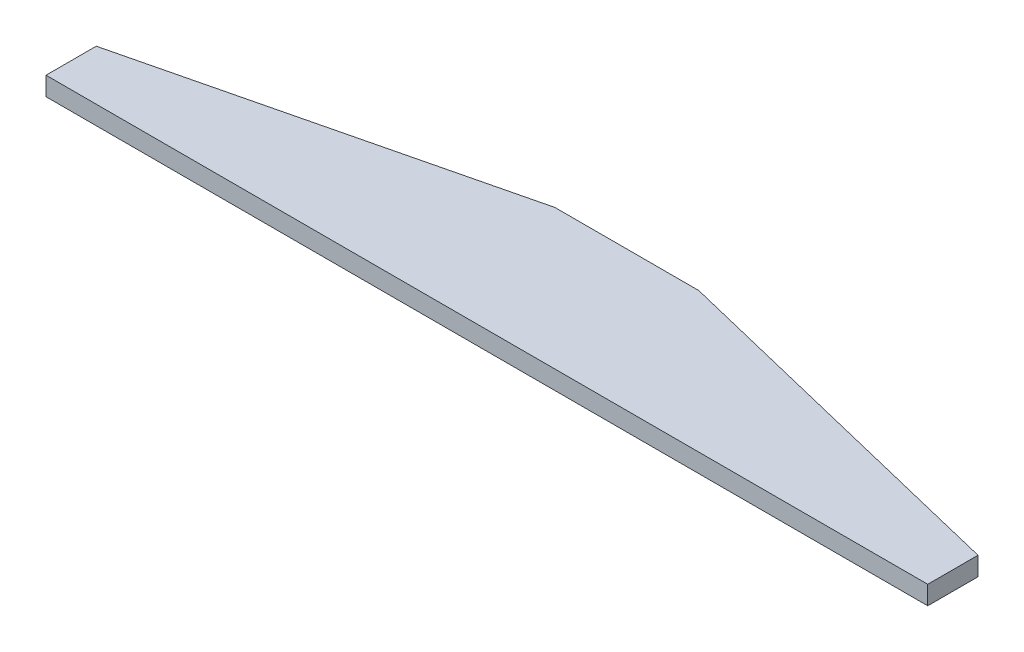
ISO-10303-21;
HEADER;
FILE_DESCRIPTION(('STEP AP214'),'2;1');
FILE_NAME('part.step','',(''),(''),'','','');
FILE_SCHEMA(('AUTOMOTIVE_DESIGN { 1 0 10303 214 1 1 1 1 }'));
ENDSEC;
DATA;
#1=APPLICATION_CONTEXT('core data for automotive mechanical design processes');
#2=APPLICATION_PROTOCOL_DEFINITION('international standard','automotive_design',2000,#1);
#3=PRODUCT_CONTEXT('',#1,'mechanical');
#4=PRODUCT('Part','Part','',(#3));
#5=PRODUCT_RELATED_PRODUCT_CATEGORY('part','',(#4));
#6=PRODUCT_DEFINITION_FORMATION('','',#4);
#7=PRODUCT_DEFINITION_CONTEXT('part definition',#1,'design');
#8=PRODUCT_DEFINITION('design','',#6,#7);
#9=PRODUCT_DEFINITION_SHAPE('','',#8);
#10=(LENGTH_UNIT() NAMED_UNIT(*) SI_UNIT(.MILLI.,.METRE.));
#11=(NAMED_UNIT(*) PLANE_ANGLE_UNIT() SI_UNIT($,.RADIAN.));
#12=(NAMED_UNIT(*) SI_UNIT($,.STERADIAN.) SOLID_ANGLE_UNIT());
#13=UNCERTAINTY_MEASURE_WITH_UNIT(LENGTH_MEASURE(1.E-05),#10,'distance_accuracy_value','');
#14=(GEOMETRIC_REPRESENTATION_CONTEXT(3) GLOBAL_UNCERTAINTY_ASSIGNED_CONTEXT((#13)) GLOBAL_UNIT_ASSIGNED_CONTEXT((#10,
#11,#12)) REPRESENTATION_CONTEXT('',''));
#15=CARTESIAN_POINT('',(0.,0.,0.));
#16=DIRECTION('',(0.,0.,1.));
#17=DIRECTION('',(1.,0.,0.));
#18=AXIS2_PLACEMENT_3D('',#15,#16,#17);
#19=CARTESIAN_POINT('',(0.,-66.,0.100005032445752));
#20=DIRECTION('',(0.,-1.,0.));
#21=DIRECTION('',(0.,0.,-1.));
#22=AXIS2_PLACEMENT_3D('',#19,#20,#21);
#23=PLANE('',#22);
#24=DIRECTION('',(1.,0.,0.));
#25=VECTOR('',#24,1.);
#26=CARTESIAN_POINT('',(12.2479912543632,-66.,-35.0499899351083));
#27=LINE('',#26,#25);
#28=CARTESIAN_POINT('',(12.2479912543632,-66.,-35.0499899351083));
#29=VERTEX_POINT('',#28);
#30=CARTESIAN_POINT('',(-12.2479912543633,-66.,-35.0499899351083));
#31=VERTEX_POINT('',#30);
#32=EDGE_CURVE('E71',#29,#31,#27,.F.);
#33=ORIENTED_EDGE('',*,*,#32,.F.);
#34=DIRECTION('',(-0.971716527763962,0.,-0.236150353949236));
#35=VECTOR('',#34,1.);
#36=CARTESIAN_POINT('',(74.9989956626465,-66.,-19.7999952316265));
#37=LINE('',#36,#35);
#38=CARTESIAN_POINT('',(74.9989956626465,-66.,-19.7999952316265));
#39=VERTEX_POINT('',#38);
#40=EDGE_CURVE('E66',#39,#29,#37,.T.);
#41=ORIENTED_EDGE('',*,*,#40,.F.);
#42=DIRECTION('',(4.7925581098139E-09,0.,-1.));
#43=VECTOR('',#42,1.);
#44=CARTESIAN_POINT('',(74.9989954719027,-66.,20.0000045776342));
#45=LINE('',#44,#43);
#46=CARTESIAN_POINT('',(74.9989956421583,-66.,-11.2499999999998));
#47=VERTEX_POINT('',#46);
#48=EDGE_CURVE('E93',#47,#39,#45,.T.);
#49=ORIENTED_EDGE('',*,*,#48,.F.);
#50=DIRECTION('',(-1.,0.,0.));
#51=VECTOR('',#50,1.);
#52=CARTESIAN_POINT('',(2.01227923213309E-13,-66.,-11.2500000000001));
#53=LINE('',#52,#51);
#54=CARTESIAN_POINT('',(-74.9989956216703,-66.,-11.2500000000002));
#55=VERTEX_POINT('',#54);
#56=EDGE_CURVE('E97',#47,#55,#53,.T.);
#57=ORIENTED_EDGE('',*,*,#56,.T.);
#58=DIRECTION('',(4.79255766349309E-09,0.,1.));
#59=VECTOR('',#58,1.);
#60=CARTESIAN_POINT('',(-74.9989956626466,-66.,-19.7999952316265));
#61=LINE('',#60,#59);
#62=CARTESIAN_POINT('',(-74.9989956524025,-66.,-19.799995234116));
#63=VERTEX_POINT('',#62);
#64=EDGE_CURVE('E82',#63,#55,#61,.T.);
#65=ORIENTED_EDGE('',*,*,#64,.F.);
#66=DIRECTION('',(-0.971716527763962,0.,0.236150353949236));
#67=VECTOR('',#66,1.);
#68=CARTESIAN_POINT('',(-12.2479912543633,-66.,-35.0499899351083));
#69=LINE('',#68,#67);
#70=EDGE_CURVE('E20',#31,#63,#69,.T.);
#71=ORIENTED_EDGE('',*,*,#70,.F.);
#72=EDGE_LOOP('',(#33,#41,#49,#57,#65,#71));
#73=FACE_BOUND('',#72,.T.);
#74=ADVANCED_FACE('F17',(#73),#23,.T.);
#75=CARTESIAN_POINT('',(-12.2479912543633,-66.,-35.0499899351083));
#76=DIRECTION('',(-0.236150353949236,0.,-0.971716527763962));
#77=DIRECTION('',(-0.971716527763962,0.,0.236150353949236));
#78=AXIS2_PLACEMENT_3D('',#75,#76,#77);
#79=PLANE('',#78);
#80=ORIENTED_EDGE('',*,*,#70,.T.);
#81=DIRECTION('',(0.,1.,0.));
#82=VECTOR('',#81,1.);
#83=CARTESIAN_POINT('',(-74.9989956626466,-66.,-19.7999952316264));
#84=LINE('',#83,#82);
#85=CARTESIAN_POINT('',(-74.9989956524054,-62.825,-19.7999952341153));
#86=VERTEX_POINT('',#85);
#87=EDGE_CURVE('E102',#86,#63,#84,.F.);
#88=ORIENTED_EDGE('',*,*,#87,.F.);
#89=DIRECTION('',(0.971716527763962,0.,-0.236150353949237));
#90=VECTOR('',#89,1.);
#91=CARTESIAN_POINT('',(-74.9989956626466,-62.825,-19.7999952316264));
#92=LINE('',#91,#90);
#93=CARTESIAN_POINT('',(-12.2479912543633,-62.825,-35.0499899351083));
#94=VERTEX_POINT('',#93);
#95=EDGE_CURVE('E88',#86,#94,#92,.T.);
#96=ORIENTED_EDGE('',*,*,#95,.T.);
#97=DIRECTION('',(0.,1.,0.));
#98=VECTOR('',#97,1.);
#99=CARTESIAN_POINT('',(-12.2479912543633,-66.,-35.0499899351083));
#100=LINE('',#99,#98);
#101=EDGE_CURVE('E76',#31,#94,#100,.T.);
#102=ORIENTED_EDGE('',*,*,#101,.F.);
#103=EDGE_LOOP('',(#80,#88,#96,#102));
#104=FACE_BOUND('',#103,.T.);
#105=ADVANCED_FACE('F87',(#104),#79,.T.);
#106=CARTESIAN_POINT('',(12.2479912543632,-66.,-35.0499899351083));
#107=DIRECTION('',(0.,0.,-1.));
#108=DIRECTION('',(0.,1.,0.));
#109=AXIS2_PLACEMENT_3D('',#106,#107,#108);
#110=PLANE('',#109);
#111=ORIENTED_EDGE('',*,*,#32,.T.);
#112=ORIENTED_EDGE('',*,*,#101,.T.);
#113=DIRECTION('',(1.,0.,0.));
#114=VECTOR('',#113,1.);
#115=CARTESIAN_POINT('',(0.,-62.8249999999999,-35.0499899351083));
#116=LINE('',#115,#114);
#117=CARTESIAN_POINT('',(12.2479912543632,-62.825,-35.0499899351083));
#118=VERTEX_POINT('',#117);
#119=EDGE_CURVE('E107',#94,#118,#116,.T.);
#120=ORIENTED_EDGE('',*,*,#119,.T.);
#121=DIRECTION('',(0.,1.,0.));
#122=VECTOR('',#121,1.);
#123=CARTESIAN_POINT('',(12.2479912543632,-66.,-35.0499899351083));
#124=LINE('',#123,#122);
#125=EDGE_CURVE('E78',#29,#118,#124,.T.);
#126=ORIENTED_EDGE('',*,*,#125,.F.);
#127=EDGE_LOOP('',(#111,#112,#120,#126));
#128=FACE_BOUND('',#127,.T.);
#129=ADVANCED_FACE('F73',(#128),#110,.T.);
#130=CARTESIAN_POINT('',(74.9989956626465,-66.,-19.7999952316265));
#131=DIRECTION('',(0.236150353949236,0.,-0.971716527763962));
#132=DIRECTION('',(-0.971716527763962,0.,-0.236150353949236));
#133=AXIS2_PLACEMENT_3D('',#130,#131,#132);
#134=PLANE('',#133);
#135=ORIENTED_EDGE('',*,*,#40,.T.);
#136=ORIENTED_EDGE('',*,*,#125,.T.);
#137=DIRECTION('',(0.971716527763962,0.,0.236150353949236));
#138=VECTOR('',#137,1.);
#139=CARTESIAN_POINT('',(12.2479912543632,-62.8249999999999,-35.0499899351083));
#140=LINE('',#139,#138);
#141=CARTESIAN_POINT('',(74.9989956626465,-62.825,-19.7999952316265));
#142=VERTEX_POINT('',#141);
#143=EDGE_CURVE('E109',#118,#142,#140,.T.);
#144=ORIENTED_EDGE('',*,*,#143,.T.);
#145=DIRECTION('',(0.,1.,0.));
#146=VECTOR('',#145,1.);
#147=CARTESIAN_POINT('',(74.9989956626465,-66.,-19.7999952316265));
#148=LINE('',#147,#146);
#149=EDGE_CURVE('E95',#39,#142,#148,.T.);
#150=ORIENTED_EDGE('',*,*,#149,.F.);
#151=EDGE_LOOP('',(#135,#136,#144,#150));
#152=FACE_BOUND('',#151,.T.);
#153=ADVANCED_FACE('F126',(#152),#134,.T.);
#154=CARTESIAN_POINT('',(74.9989954719027,-66.,20.0000045776342));
#155=DIRECTION('',(1.,0.,4.7925581098139E-09));
#156=DIRECTION('',(4.7925581098139E-09,0.,-1.));
#157=AXIS2_PLACEMENT_3D('',#154,#155,#156);
#158=PLANE('',#157);
#159=ORIENTED_EDGE('',*,*,#48,.T.);
#160=ORIENTED_EDGE('',*,*,#149,.T.);
#161=DIRECTION('',(0.,0.,-1.));
#162=VECTOR('',#161,1.);
#163=CARTESIAN_POINT('',(74.9989956626465,-62.825,0.100005032445854));
#164=LINE('',#163,#162);
#165=CARTESIAN_POINT('',(74.9989956319143,-62.825,-11.2499999999998));
#166=VERTEX_POINT('',#165);
#167=EDGE_CURVE('E112',#142,#166,#164,.F.);
#168=ORIENTED_EDGE('',*,*,#167,.T.);
#169=DIRECTION('',(0.,1.,0.));
#170=VECTOR('',#169,1.);
#171=CARTESIAN_POINT('',(74.9989956216702,-30.5433363392091,-11.2499999999997));
#172=LINE('',#171,#170);
#173=EDGE_CURVE('E99',#166,#47,#172,.F.);
#174=ORIENTED_EDGE('',*,*,#173,.T.);
#175=EDGE_LOOP('',(#159,#160,#168,#174));
#176=FACE_BOUND('',#175,.T.);
#177=ADVANCED_FACE('F124',(#176),#158,.T.);
#178=CARTESIAN_POINT('',(2.01227923213309E-13,-30.5433363392091,-11.2500000000001));
#179=DIRECTION('',(0.,0.,-1.));
#180=DIRECTION('',(-1.,0.,0.));
#181=AXIS2_PLACEMENT_3D('',#178,#179,#180);
#182=PLANE('',#181);
#183=DIRECTION('',(1.,0.,0.));
#184=VECTOR('',#183,1.);
#185=CARTESIAN_POINT('',(0.,-62.825,-11.2499999999998));
#186=LINE('',#185,#184);
#187=CARTESIAN_POINT('',(-74.9989956216731,-62.825,-11.2500000000004));
#188=VERTEX_POINT('',#187);
#189=EDGE_CURVE('E26',#166,#188,#186,.F.);
#190=ORIENTED_EDGE('',*,*,#189,.T.);
#191=DIRECTION('',(0.,1.,0.));
#192=VECTOR('',#191,1.);
#193=CARTESIAN_POINT('',(-74.9989956216703,-66.,-11.2500000000006));
#194=LINE('',#193,#192);
#195=EDGE_CURVE('E34',#55,#188,#194,.T.);
#196=ORIENTED_EDGE('',*,*,#195,.F.);
#197=ORIENTED_EDGE('',*,*,#56,.F.);
#198=ORIENTED_EDGE('',*,*,#173,.F.);
#199=EDGE_LOOP('',(#190,#196,#197,#198));
#200=FACE_BOUND('',#199,.T.);
#201=ADVANCED_FACE('F118',(#200),#182,.F.);
#202=CARTESIAN_POINT('',(-74.9989956626466,-66.,-19.7999952316265));
#203=DIRECTION('',(-1.,0.,4.79255766349309E-09));
#204=DIRECTION('',(4.79255766349309E-09,0.,1.));
#205=AXIS2_PLACEMENT_3D('',#202,#203,#204);
#206=PLANE('',#205);
#207=ORIENTED_EDGE('',*,*,#64,.T.);
#208=ORIENTED_EDGE('',*,*,#195,.T.);
#209=DIRECTION('',(0.,0.,-1.));
#210=VECTOR('',#209,1.);
#211=CARTESIAN_POINT('',(-74.9989956216817,-62.825,0.100005032445854));
#212=LINE('',#211,#210);
#213=EDGE_CURVE('E11',#188,#86,#212,.T.);
#214=ORIENTED_EDGE('',*,*,#213,.T.);
#215=ORIENTED_EDGE('',*,*,#87,.T.);
#216=EDGE_LOOP('',(#207,#208,#214,#215));
#217=FACE_BOUND('',#216,.T.);
#218=ADVANCED_FACE('F127',(#217),#206,.T.);
#219=CARTESIAN_POINT('',(0.,-62.825,0.100005032445854));
#220=DIRECTION('',(0.,-1.,0.));
#221=DIRECTION('',(0.,0.,-1.));
#222=AXIS2_PLACEMENT_3D('',#219,#220,#221);
#223=PLANE('',#222);
#224=ORIENTED_EDGE('',*,*,#189,.F.);
#225=ORIENTED_EDGE('',*,*,#167,.F.);
#226=ORIENTED_EDGE('',*,*,#143,.F.);
#227=ORIENTED_EDGE('',*,*,#119,.F.);
#228=ORIENTED_EDGE('',*,*,#95,.F.);
#229=ORIENTED_EDGE('',*,*,#213,.F.);
#230=EDGE_LOOP('',(#224,#225,#226,#227,#228,#229));
#231=FACE_BOUND('',#230,.T.);
#232=ADVANCED_FACE('F121',(#231),#223,.F.);
#233=CLOSED_SHELL('',(#74,#105,#129,#153,#177,#201,#218,#232));
#234=MANIFOLD_SOLID_BREP('B1',#233);
#235=ADVANCED_BREP_SHAPE_REPRESENTATION('',(#18,#234),#14);
#236=SHAPE_DEFINITION_REPRESENTATION(#9,#235);
ENDSEC;
END-ISO-10303-21;
